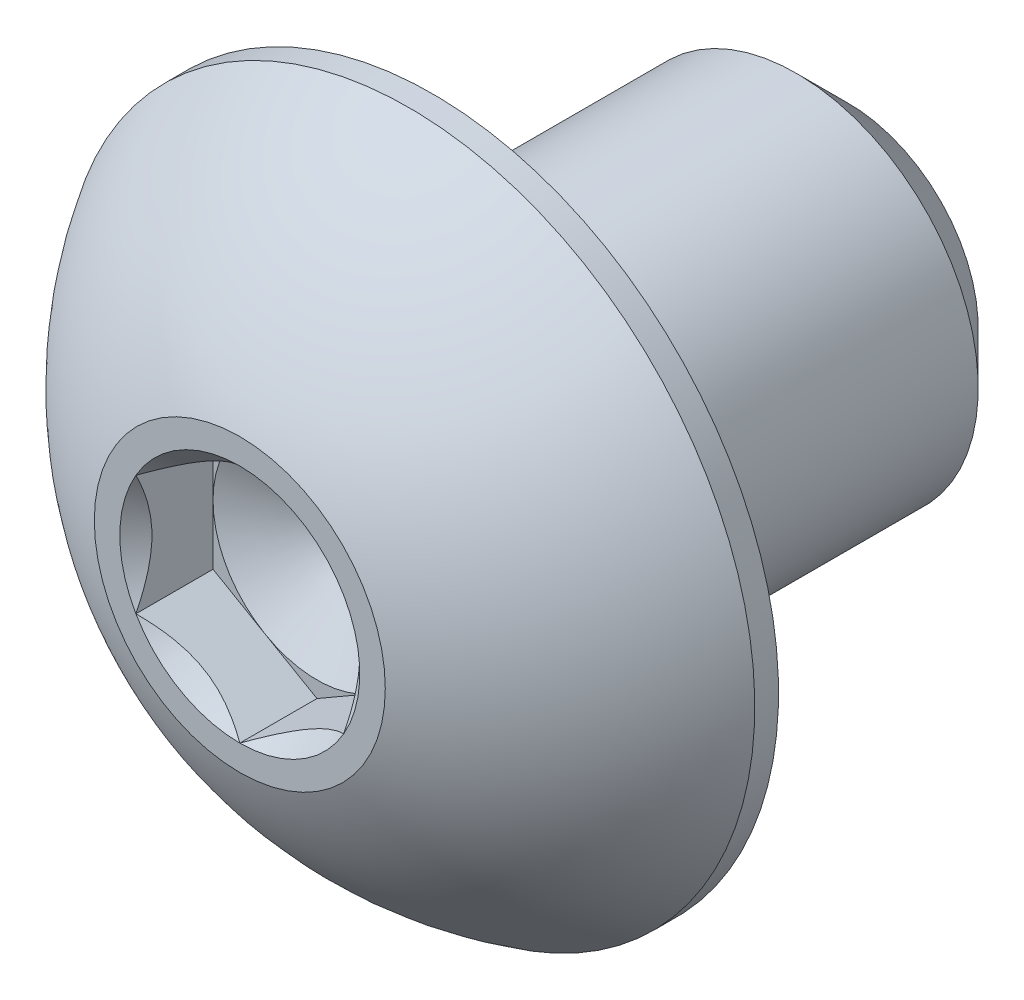
ISO-10303-21;
HEADER;
FILE_DESCRIPTION(('STEP AP214'),'2;1');
FILE_NAME('part.step','',(''),(''),'','','');
FILE_SCHEMA(('AUTOMOTIVE_DESIGN { 1 0 10303 214 1 1 1 1 }'));
ENDSEC;
DATA;
#1=APPLICATION_CONTEXT('core data for automotive mechanical design processes');
#2=APPLICATION_PROTOCOL_DEFINITION('international standard','automotive_design',2000,#1);
#3=PRODUCT_CONTEXT('',#1,'mechanical');
#4=PRODUCT('Part','Part','',(#3));
#5=PRODUCT_RELATED_PRODUCT_CATEGORY('part','',(#4));
#6=PRODUCT_DEFINITION_FORMATION('','',#4);
#7=PRODUCT_DEFINITION_CONTEXT('part definition',#1,'design');
#8=PRODUCT_DEFINITION('design','',#6,#7);
#9=PRODUCT_DEFINITION_SHAPE('','',#8);
#10=(LENGTH_UNIT() NAMED_UNIT(*) SI_UNIT(.MILLI.,.METRE.));
#11=(NAMED_UNIT(*) PLANE_ANGLE_UNIT() SI_UNIT($,.RADIAN.));
#12=(NAMED_UNIT(*) SI_UNIT($,.STERADIAN.) SOLID_ANGLE_UNIT());
#13=UNCERTAINTY_MEASURE_WITH_UNIT(LENGTH_MEASURE(1.E-05),#10,'distance_accuracy_value','');
#14=(GEOMETRIC_REPRESENTATION_CONTEXT(3) GLOBAL_UNCERTAINTY_ASSIGNED_CONTEXT((#13)) GLOBAL_UNIT_ASSIGNED_CONTEXT((#10,
#11,#12)) REPRESENTATION_CONTEXT('',''));
#15=CARTESIAN_POINT('',(0.,0.,0.));
#16=DIRECTION('',(0.,0.,1.));
#17=DIRECTION('',(1.,0.,0.));
#18=AXIS2_PLACEMENT_3D('',#15,#16,#17);
#19=CARTESIAN_POINT('',(0.,0.,2.60223));
#20=DIRECTION('',(0.,0.,1.));
#21=DIRECTION('',(1.,0.,0.));
#22=AXIS2_PLACEMENT_3D('',#19,#20,#21);
#23=PLANE('',#22);
#24=DIRECTION('',(0.,1.,0.));
#25=VECTOR('',#24,1.);
#26=CARTESIAN_POINT('',(-1.190625,0.687407664253898,2.60223));
#27=LINE('',#26,#25);
#28=CARTESIAN_POINT('',(-1.190625,-0.687407664253899,2.60223));
#29=VERTEX_POINT('',#28);
#30=CARTESIAN_POINT('',(-1.1906249999678,2.16066967707726E-13,2.60222999997774));
#31=VERTEX_POINT('',#30);
#32=EDGE_CURVE('E11',#29,#31,#27,.T.);
#33=ORIENTED_EDGE('',*,*,#32,.F.);
#34=DIRECTION('',(-0.866025403784439,0.5,0.));
#35=VECTOR('',#34,1.);
#36=CARTESIAN_POINT('',(-1.190625,-0.687407664253899,2.60223));
#37=LINE('',#36,#35);
#38=CARTESIAN_POINT('',(-0.595312499983901,-1.03111149635297,2.60222999997774));
#39=VERTEX_POINT('',#38);
#40=EDGE_CURVE('E257',#39,#29,#37,.T.);
#41=ORIENTED_EDGE('',*,*,#40,.F.);
#42=CARTESIAN_POINT('',(0.,0.,2.60222999995547));
#43=DIRECTION('',(0.,0.,-1.));
#44=DIRECTION('',(1.,0.,0.));
#45=AXIS2_PLACEMENT_3D('',#42,#43,#44);
#46=CIRCLE('',#45,1.19062499993561);
#47=EDGE_CURVE('E179',#39,#31,#46,.T.);
#48=ORIENTED_EDGE('',*,*,#47,.T.);
#49=EDGE_LOOP('',(#33,#41,#48));
#50=FACE_BOUND('',#49,.T.);
#51=ADVANCED_FACE('F17',(#50),#23,.T.);
#52=CARTESIAN_POINT('',(0.,0.,2.60223));
#53=DIRECTION('',(0.,0.,1.));
#54=DIRECTION('',(1.,0.,0.));
#55=AXIS2_PLACEMENT_3D('',#52,#53,#54);
#56=PLANE('',#55);
#57=DIRECTION('',(-0.866025403784439,0.5,0.));
#58=VECTOR('',#57,1.);
#59=CARTESIAN_POINT('',(-1.190625,-0.687407664253899,2.60223));
#60=LINE('',#59,#58);
#61=CARTESIAN_POINT('',(0.,-1.3748153285078,2.60223));
#62=VERTEX_POINT('',#61);
#63=EDGE_CURVE('E263',#62,#39,#60,.T.);
#64=ORIENTED_EDGE('',*,*,#63,.F.);
#65=DIRECTION('',(-0.866025403784439,-0.5,0.));
#66=VECTOR('',#65,1.);
#67=CARTESIAN_POINT('',(0.,-1.3748153285078,2.60223));
#68=LINE('',#67,#66);
#69=CARTESIAN_POINT('',(0.595312499983902,-1.03111149635296,2.60222999997774));
#70=VERTEX_POINT('',#69);
#71=EDGE_CURVE('E145',#70,#62,#68,.T.);
#72=ORIENTED_EDGE('',*,*,#71,.F.);
#73=CARTESIAN_POINT('',(0.,0.,2.60222999995547));
#74=DIRECTION('',(0.,0.,-1.));
#75=DIRECTION('',(1.,0.,0.));
#76=AXIS2_PLACEMENT_3D('',#73,#74,#75);
#77=CIRCLE('',#76,1.19062499993561);
#78=EDGE_CURVE('E172',#70,#39,#77,.T.);
#79=ORIENTED_EDGE('',*,*,#78,.T.);
#80=EDGE_LOOP('',(#64,#72,#79));
#81=FACE_BOUND('',#80,.T.);
#82=ADVANCED_FACE('F309',(#81),#56,.T.);
#83=CARTESIAN_POINT('',(0.,0.,2.60223));
#84=DIRECTION('',(0.,0.,1.));
#85=DIRECTION('',(1.,0.,0.));
#86=AXIS2_PLACEMENT_3D('',#83,#84,#85);
#87=PLANE('',#86);
#88=DIRECTION('',(-0.866025403784439,-0.5,0.));
#89=VECTOR('',#88,1.);
#90=CARTESIAN_POINT('',(0.,-1.3748153285078,2.60223));
#91=LINE('',#90,#89);
#92=CARTESIAN_POINT('',(1.190625,-0.687407664253898,2.60223));
#93=VERTEX_POINT('',#92);
#94=EDGE_CURVE('E154',#93,#70,#91,.T.);
#95=ORIENTED_EDGE('',*,*,#94,.F.);
#96=DIRECTION('',(0.,-1.,0.));
#97=VECTOR('',#96,1.);
#98=CARTESIAN_POINT('',(1.190625,-0.687407664253898,2.60223));
#99=LINE('',#98,#97);
#100=CARTESIAN_POINT('',(1.1906249999678,0.,2.60222999997774));
#101=VERTEX_POINT('',#100);
#102=EDGE_CURVE('E140',#101,#93,#99,.T.);
#103=ORIENTED_EDGE('',*,*,#102,.F.);
#104=CARTESIAN_POINT('',(0.,0.,2.60222999995547));
#105=DIRECTION('',(0.,0.,-1.));
#106=DIRECTION('',(1.,0.,0.));
#107=AXIS2_PLACEMENT_3D('',#104,#105,#106);
#108=CIRCLE('',#107,1.19062499993561);
#109=EDGE_CURVE('E152',#101,#70,#108,.T.);
#110=ORIENTED_EDGE('',*,*,#109,.T.);
#111=EDGE_LOOP('',(#95,#103,#110));
#112=FACE_BOUND('',#111,.T.);
#113=ADVANCED_FACE('F150',(#112),#87,.T.);
#114=CARTESIAN_POINT('',(0.,0.,2.60223));
#115=DIRECTION('',(0.,0.,1.));
#116=DIRECTION('',(1.,0.,0.));
#117=AXIS2_PLACEMENT_3D('',#114,#115,#116);
#118=PLANE('',#117);
#119=DIRECTION('',(0.,-1.,0.));
#120=VECTOR('',#119,1.);
#121=CARTESIAN_POINT('',(1.190625,-0.687407664253898,2.60223));
#122=LINE('',#121,#120);
#123=CARTESIAN_POINT('',(1.190625,0.687407664253899,2.60223));
#124=VERTEX_POINT('',#123);
#125=EDGE_CURVE('E137',#124,#101,#122,.T.);
#126=ORIENTED_EDGE('',*,*,#125,.F.);
#127=DIRECTION('',(0.866025403784439,-0.5,0.));
#128=VECTOR('',#127,1.);
#129=CARTESIAN_POINT('',(1.190625,0.687407664253899,2.60223));
#130=LINE('',#129,#128);
#131=CARTESIAN_POINT('',(0.595312499983901,1.03111149635297,2.60222999997774));
#132=VERTEX_POINT('',#131);
#133=EDGE_CURVE('E161',#132,#124,#130,.T.);
#134=ORIENTED_EDGE('',*,*,#133,.F.);
#135=CARTESIAN_POINT('',(0.,0.,2.60222999995547));
#136=DIRECTION('',(0.,0.,-1.));
#137=DIRECTION('',(1.,0.,0.));
#138=AXIS2_PLACEMENT_3D('',#135,#136,#137);
#139=CIRCLE('',#138,1.19062499993561);
#140=EDGE_CURVE('E159',#132,#101,#139,.T.);
#141=ORIENTED_EDGE('',*,*,#140,.T.);
#142=EDGE_LOOP('',(#126,#134,#141));
#143=FACE_BOUND('',#142,.T.);
#144=ADVANCED_FACE('F160',(#143),#118,.T.);
#145=CARTESIAN_POINT('',(0.,0.,2.60223));
#146=DIRECTION('',(0.,0.,1.));
#147=DIRECTION('',(1.,0.,0.));
#148=AXIS2_PLACEMENT_3D('',#145,#146,#147);
#149=PLANE('',#148);
#150=DIRECTION('',(0.866025403784439,0.5,0.));
#151=VECTOR('',#150,1.);
#152=CARTESIAN_POINT('',(0.,1.3748153285078,2.60223));
#153=LINE('',#152,#151);
#154=CARTESIAN_POINT('',(-1.190625,0.687407664253898,2.60223));
#155=VERTEX_POINT('',#154);
#156=CARTESIAN_POINT('',(-0.595312499983902,1.03111149635296,2.60222999997774));
#157=VERTEX_POINT('',#156);
#158=EDGE_CURVE('E214',#155,#157,#153,.T.);
#159=ORIENTED_EDGE('',*,*,#158,.F.);
#160=DIRECTION('',(0.,1.,0.));
#161=VECTOR('',#160,1.);
#162=CARTESIAN_POINT('',(-1.190625,0.687407664253898,2.60223));
#163=LINE('',#162,#161);
#164=EDGE_CURVE('E30',#31,#155,#163,.T.);
#165=ORIENTED_EDGE('',*,*,#164,.F.);
#166=CARTESIAN_POINT('',(0.,0.,2.60222999995547));
#167=DIRECTION('',(0.,0.,-1.));
#168=DIRECTION('',(1.,0.,0.));
#169=AXIS2_PLACEMENT_3D('',#166,#167,#168);
#170=CIRCLE('',#169,1.19062499993561);
#171=EDGE_CURVE('E220',#31,#157,#170,.T.);
#172=ORIENTED_EDGE('',*,*,#171,.T.);
#173=EDGE_LOOP('',(#159,#165,#172));
#174=FACE_BOUND('',#173,.T.);
#175=ADVANCED_FACE('F683',(#174),#149,.T.);
#176=CARTESIAN_POINT('',(0.,0.,2.60223));
#177=DIRECTION('',(0.,0.,1.));
#178=DIRECTION('',(1.,0.,0.));
#179=AXIS2_PLACEMENT_3D('',#176,#177,#178);
#180=PLANE('',#179);
#181=DIRECTION('',(0.866025403784439,-0.5,0.));
#182=VECTOR('',#181,1.);
#183=CARTESIAN_POINT('',(1.190625,0.687407664253899,2.60223));
#184=LINE('',#183,#182);
#185=CARTESIAN_POINT('',(0.,1.3748153285078,2.60223));
#186=VERTEX_POINT('',#185);
#187=EDGE_CURVE('E156',#186,#132,#184,.T.);
#188=ORIENTED_EDGE('',*,*,#187,.F.);
#189=DIRECTION('',(0.866025403784439,0.5,0.));
#190=VECTOR('',#189,1.);
#191=CARTESIAN_POINT('',(0.,1.3748153285078,2.60223));
#192=LINE('',#191,#190);
#193=EDGE_CURVE('E192',#157,#186,#192,.T.);
#194=ORIENTED_EDGE('',*,*,#193,.F.);
#195=CARTESIAN_POINT('',(0.,0.,2.60222999995547));
#196=DIRECTION('',(0.,0.,-1.));
#197=DIRECTION('',(1.,0.,0.));
#198=AXIS2_PLACEMENT_3D('',#195,#196,#197);
#199=CIRCLE('',#198,1.19062499993561);
#200=EDGE_CURVE('E166',#157,#132,#199,.T.);
#201=ORIENTED_EDGE('',*,*,#200,.T.);
#202=EDGE_LOOP('',(#188,#194,#201));
#203=FACE_BOUND('',#202,.T.);
#204=ADVANCED_FACE('F672',(#203),#180,.T.);
#205=CARTESIAN_POINT('',(-1.190625,0.687407664253898,3.48615));
#206=DIRECTION('',(1.,0.,0.));
#207=DIRECTION('',(0.,1.,0.));
#208=AXIS2_PLACEMENT_3D('',#205,#206,#207);
#209=PLANE('',#208);
#210=ORIENTED_EDGE('',*,*,#164,.T.);
#211=DIRECTION('',(0.,0.,-1.));
#212=VECTOR('',#211,1.);
#213=CARTESIAN_POINT('',(-1.190625,0.687407664253898,3.48615));
#214=LINE('',#213,#212);
#215=CARTESIAN_POINT('',(-1.19062499995943,0.687407664264676,3.48615000003183));
#216=VERTEX_POINT('',#215);
#217=EDGE_CURVE('E191',#216,#155,#214,.T.);
#218=ORIENTED_EDGE('',*,*,#217,.F.);
#219=CARTESIAN_POINT('',(-1.190625,0.687407664250615,3.48615000005993));
#220=CARTESIAN_POINT('',(-1.190625,5.79805647937803E-12,3.14244616804419));
#221=CARTESIAN_POINT('',(-1.190625,-0.687407664235154,3.4861500000522));
#222=(BOUNDED_CURVE() B_SPLINE_CURVE(2,(#219,#220,#221),.UNSPECIFIED.,.F.,
.F.) B_SPLINE_CURVE_WITH_KNOTS((3,3),(0.126894256979399,0.347424905152073),
.UNSPECIFIED.) CURVE() GEOMETRIC_REPRESENTATION_ITEM() RATIONAL_B_SPLINE_CURVE((1.38979663224803,
1.60479891949046,1.38979663225222)) REPRESENTATION_ITEM(''));
#223=CARTESIAN_POINT('',(-1.19062499997972,-0.687407664242189,3.48615000003815));
#224=VERTEX_POINT('',#223);
#225=EDGE_CURVE('E21',#216,#224,#222,.T.);
#226=ORIENTED_EDGE('',*,*,#225,.T.);
#227=DIRECTION('',(0.,0.,1.));
#228=VECTOR('',#227,1.);
#229=CARTESIAN_POINT('',(-1.190625,-0.687407664253899,3.48615));
#230=LINE('',#229,#228);
#231=EDGE_CURVE('E289',#29,#224,#230,.T.);
#232=ORIENTED_EDGE('',*,*,#231,.F.);
#233=ORIENTED_EDGE('',*,*,#32,.T.);
#234=EDGE_LOOP('',(#210,#218,#226,#232,#233));
#235=FACE_BOUND('',#234,.T.);
#236=ADVANCED_FACE('F663',(#235),#209,.T.);
#237=CARTESIAN_POINT('',(-1.190625,-0.687407664253899,3.48615));
#238=DIRECTION('',(0.5,0.866025403784439,0.));
#239=DIRECTION('',(0.,0.,-1.));
#240=AXIS2_PLACEMENT_3D('',#237,#238,#239);
#241=PLANE('',#240);
#242=ORIENTED_EDGE('',*,*,#40,.T.);
#243=ORIENTED_EDGE('',*,*,#231,.T.);
#244=CARTESIAN_POINT('',(-1.19062499998377,-0.687407664263272,3.4861500000522));
#245=CARTESIAN_POINT('',(-0.595312499999999,-1.03111149638085,3.14244616804698));
#246=CARTESIAN_POINT('',(-1.62321981368385E-11,-1.37481532849843,3.4861500000522));
#247=(BOUNDED_CURVE() B_SPLINE_CURVE(2,(#244,#245,#246),.UNSPECIFIED.,.F.,
.F.) B_SPLINE_CURVE_WITH_KNOTS((3,3),(0.126894256981522,0.347424905152042),
.UNSPECIFIED.) CURVE() GEOMETRIC_REPRESENTATION_ITEM() RATIONAL_B_SPLINE_CURVE((1.3897966322521,
1.60479891948823,1.3897966322521)) REPRESENTATION_ITEM(''));
#248=CARTESIAN_POINT('',(0.,-1.37481532848438,3.48615000003815));
#249=VERTEX_POINT('',#248);
#250=EDGE_CURVE('E280',#224,#249,#247,.T.);
#251=ORIENTED_EDGE('',*,*,#250,.T.);
#252=DIRECTION('',(0.,0.,1.));
#253=VECTOR('',#252,1.);
#254=CARTESIAN_POINT('',(0.,-1.3748153285078,3.48615));
#255=LINE('',#254,#253);
#256=EDGE_CURVE('E236',#62,#249,#255,.T.);
#257=ORIENTED_EDGE('',*,*,#256,.F.);
#258=ORIENTED_EDGE('',*,*,#63,.T.);
#259=EDGE_LOOP('',(#242,#243,#251,#257,#258));
#260=FACE_BOUND('',#259,.T.);
#261=ADVANCED_FACE('F303',(#260),#241,.T.);
#262=CARTESIAN_POINT('',(0.,-1.3748153285078,3.48615));
#263=DIRECTION('',(-0.5,0.866025403784439,0.));
#264=DIRECTION('',(0.,0.,1.));
#265=AXIS2_PLACEMENT_3D('',#262,#263,#264);
#266=PLANE('',#265);
#267=ORIENTED_EDGE('',*,*,#71,.T.);
#268=ORIENTED_EDGE('',*,*,#256,.T.);
#269=CARTESIAN_POINT('',(1.62357929099837E-11,-1.37481532849842,3.4861500000522));
#270=CARTESIAN_POINT('',(0.5953125,-1.03111149638085,3.14244616804699));
#271=CARTESIAN_POINT('',(1.19062499998376,-0.687407664263271,3.4861500000522));
#272=(BOUNDED_CURVE() B_SPLINE_CURVE(2,(#269,#270,#271),.UNSPECIFIED.,.F.,
.F.) B_SPLINE_CURVE_WITH_KNOTS((3,3),(0.126894256981523,0.347424905152041),
.UNSPECIFIED.) CURVE() GEOMETRIC_REPRESENTATION_ITEM() RATIONAL_B_SPLINE_CURVE((1.3897966322521,
1.60479891948823,1.3897966322521)) REPRESENTATION_ITEM(''));
#273=CARTESIAN_POINT('',(1.19062499997972,-0.687407664242187,3.48615000003815));
#274=VERTEX_POINT('',#273);
#275=EDGE_CURVE('E275',#249,#274,#272,.T.);
#276=ORIENTED_EDGE('',*,*,#275,.T.);
#277=DIRECTION('',(0.,0.,1.));
#278=VECTOR('',#277,1.);
#279=CARTESIAN_POINT('',(1.190625,-0.687407664253898,3.48615));
#280=LINE('',#279,#278);
#281=EDGE_CURVE('E94',#93,#274,#280,.T.);
#282=ORIENTED_EDGE('',*,*,#281,.F.);
#283=ORIENTED_EDGE('',*,*,#94,.T.);
#284=EDGE_LOOP('',(#267,#268,#276,#282,#283));
#285=FACE_BOUND('',#284,.T.);
#286=ADVANCED_FACE('F644',(#285),#266,.T.);
#287=CARTESIAN_POINT('',(1.190625,-0.687407664253898,3.48615));
#288=DIRECTION('',(-1.,0.,0.));
#289=DIRECTION('',(0.,1.,0.));
#290=AXIS2_PLACEMENT_3D('',#287,#288,#289);
#291=PLANE('',#290);
#292=ORIENTED_EDGE('',*,*,#102,.T.);
#293=ORIENTED_EDGE('',*,*,#281,.T.);
#294=CARTESIAN_POINT('',(1.190625,-0.687407664235152,3.4861500000522));
#295=CARTESIAN_POINT('',(1.190625,0.,3.14244616804709));
#296=CARTESIAN_POINT('',(1.190625,0.687407664235153,3.4861500000522));
#297=(BOUNDED_CURVE() B_SPLINE_CURVE(2,(#294,#295,#296),.UNSPECIFIED.,.F.,
.F.) B_SPLINE_CURVE_WITH_KNOTS((3,3),(0.126894256981548,0.347424905152074),
.UNSPECIFIED.) CURVE() GEOMETRIC_REPRESENTATION_ITEM() RATIONAL_B_SPLINE_CURVE((1.38979663225222,
1.60479891948837,1.38979663225222)) REPRESENTATION_ITEM(''));
#298=CARTESIAN_POINT('',(1.19062499997972,0.687407664242187,3.48615000003815));
#299=VERTEX_POINT('',#298);
#300=EDGE_CURVE('E269',#274,#299,#297,.T.);
#301=ORIENTED_EDGE('',*,*,#300,.T.);
#302=DIRECTION('',(0.,0.,1.));
#303=VECTOR('',#302,1.);
#304=CARTESIAN_POINT('',(1.190625,0.687407664253899,3.48615));
#305=LINE('',#304,#303);
#306=EDGE_CURVE('E118',#124,#299,#305,.T.);
#307=ORIENTED_EDGE('',*,*,#306,.F.);
#308=ORIENTED_EDGE('',*,*,#125,.T.);
#309=EDGE_LOOP('',(#292,#293,#301,#307,#308));
#310=FACE_BOUND('',#309,.T.);
#311=ADVANCED_FACE('F139',(#310),#291,.T.);
#312=CARTESIAN_POINT('',(1.190625,0.687407664253899,3.48615));
#313=DIRECTION('',(-0.5,-0.866025403784439,0.));
#314=DIRECTION('',(-0.866025403784439,0.5,0.));
#315=AXIS2_PLACEMENT_3D('',#312,#313,#314);
#316=PLANE('',#315);
#317=ORIENTED_EDGE('',*,*,#133,.T.);
#318=ORIENTED_EDGE('',*,*,#306,.T.);
#319=CARTESIAN_POINT('',(1.19062499998377,0.687407664263272,3.4861500000522));
#320=CARTESIAN_POINT('',(0.5953125,1.03111149638085,3.14244616804698));
#321=CARTESIAN_POINT('',(1.62335162203251E-11,1.37481532849842,3.4861500000522));
#322=(BOUNDED_CURVE() B_SPLINE_CURVE(2,(#319,#320,#321),.UNSPECIFIED.,.F.,
.F.) B_SPLINE_CURVE_WITH_KNOTS((3,3),(0.126894256981522,0.347424905152042),
.UNSPECIFIED.) CURVE() GEOMETRIC_REPRESENTATION_ITEM() RATIONAL_B_SPLINE_CURVE((1.3897966322521,
1.60479891948823,1.3897966322521)) REPRESENTATION_ITEM(''));
#323=CARTESIAN_POINT('',(0.,1.37481532848438,3.48615000003815));
#324=VERTEX_POINT('',#323);
#325=EDGE_CURVE('E264',#299,#324,#322,.T.);
#326=ORIENTED_EDGE('',*,*,#325,.T.);
#327=DIRECTION('',(0.,0.,1.));
#328=VECTOR('',#327,1.);
#329=CARTESIAN_POINT('',(0.,1.3748153285078,3.48615));
#330=LINE('',#329,#328);
#331=EDGE_CURVE('E107',#186,#324,#330,.T.);
#332=ORIENTED_EDGE('',*,*,#331,.F.);
#333=ORIENTED_EDGE('',*,*,#187,.T.);
#334=EDGE_LOOP('',(#317,#318,#326,#332,#333));
#335=FACE_BOUND('',#334,.T.);
#336=ADVANCED_FACE('F626',(#335),#316,.T.);
#337=CARTESIAN_POINT('',(0.,1.3748153285078,3.48615));
#338=DIRECTION('',(0.5,-0.866025403784439,0.));
#339=DIRECTION('',(0.,0.,-1.));
#340=AXIS2_PLACEMENT_3D('',#337,#338,#339);
#341=PLANE('',#340);
#342=ORIENTED_EDGE('',*,*,#193,.T.);
#343=ORIENTED_EDGE('',*,*,#331,.T.);
#344=CARTESIAN_POINT('',(-1.62343550007256E-11,1.37481532849842,3.4861500000522));
#345=CARTESIAN_POINT('',(-0.595312499991694,1.03111149638564,3.14244616805178));
#346=CARTESIAN_POINT('',(-1.19062499996161,0.687407664276059,3.48615000003941));
#347=(BOUNDED_CURVE() B_SPLINE_CURVE(2,(#344,#345,#346),.UNSPECIFIED.,.F.,
.F.) B_SPLINE_CURVE_WITH_KNOTS((3,3),(0.126894256981523,0.347424905148488),
.UNSPECIFIED.) CURVE() GEOMETRIC_REPRESENTATION_ITEM() RATIONAL_B_SPLINE_CURVE((1.3897966322521,
1.60479891948476,1.38979663225903)) REPRESENTATION_ITEM(''));
#348=EDGE_CURVE('E209',#324,#216,#347,.T.);
#349=ORIENTED_EDGE('',*,*,#348,.T.);
#350=ORIENTED_EDGE('',*,*,#217,.T.);
#351=ORIENTED_EDGE('',*,*,#158,.T.);
#352=EDGE_LOOP('',(#342,#343,#349,#350,#351));
#353=FACE_BOUND('',#352,.T.);
#354=ADVANCED_FACE('F616',(#353),#341,.T.);
#355=CARTESIAN_POINT('',(0.,0.,3.48615000012842));
#356=DIRECTION('',(0.,0.,1.));
#357=DIRECTION('',(0.,-1.,0.));
#358=AXIS2_PLACEMENT_3D('',#355,#356,#357);
#359=CONICAL_SURFACE('',#358,1.37481532857464,0.785398163550829);
#360=ORIENTED_EDGE('',*,*,#225,.F.);
#361=CARTESIAN_POINT('',(0.,0.,3.48615000001473));
#362=DIRECTION('',(0.,0.,1.));
#363=DIRECTION('',(0.,-1.,0.));
#364=AXIS2_PLACEMENT_3D('',#361,#362,#363);
#365=CIRCLE('',#364,1.37481532846095);
#366=EDGE_CURVE('E210',#216,#224,#365,.T.);
#367=ORIENTED_EDGE('',*,*,#366,.T.);
#368=EDGE_LOOP('',(#360,#367));
#369=FACE_BOUND('',#368,.T.);
#370=ADVANCED_FACE('F19',(#369),#359,.F.);
#371=CARTESIAN_POINT('',(0.,0.,3.48615000012842));
#372=DIRECTION('',(0.,0.,1.));
#373=DIRECTION('',(0.,-1.,0.));
#374=AXIS2_PLACEMENT_3D('',#371,#372,#373);
#375=CONICAL_SURFACE('',#374,1.37481532857464,0.785398163550677);
#376=ORIENTED_EDGE('',*,*,#250,.F.);
#377=CARTESIAN_POINT('',(0.,0.,3.48615000001473));
#378=DIRECTION('',(0.,0.,1.));
#379=DIRECTION('',(0.,-1.,0.));
#380=AXIS2_PLACEMENT_3D('',#377,#378,#379);
#381=CIRCLE('',#380,1.37481532846095);
#382=EDGE_CURVE('E230',#224,#249,#381,.T.);
#383=ORIENTED_EDGE('',*,*,#382,.T.);
#384=EDGE_LOOP('',(#376,#383));
#385=FACE_BOUND('',#384,.T.);
#386=ADVANCED_FACE('F596',(#385),#375,.F.);
#387=CARTESIAN_POINT('',(0.,0.,3.48615000012842));
#388=DIRECTION('',(0.,0.,1.));
#389=DIRECTION('',(0.,-1.,0.));
#390=AXIS2_PLACEMENT_3D('',#387,#388,#389);
#391=CONICAL_SURFACE('',#390,1.37481532857464,0.785398163550677);
#392=ORIENTED_EDGE('',*,*,#275,.F.);
#393=CARTESIAN_POINT('',(0.,0.,3.48615000001473));
#394=DIRECTION('',(0.,0.,1.));
#395=DIRECTION('',(0.,-1.,0.));
#396=AXIS2_PLACEMENT_3D('',#393,#394,#395);
#397=CIRCLE('',#396,1.37481532846095);
#398=EDGE_CURVE('E225',#249,#274,#397,.T.);
#399=ORIENTED_EDGE('',*,*,#398,.T.);
#400=EDGE_LOOP('',(#392,#399));
#401=FACE_BOUND('',#400,.T.);
#402=ADVANCED_FACE('F585',(#401),#391,.F.);
#403=CARTESIAN_POINT('',(0.,0.,3.48615000012842));
#404=DIRECTION('',(0.,0.,1.));
#405=DIRECTION('',(0.,-1.,0.));
#406=AXIS2_PLACEMENT_3D('',#403,#404,#405);
#407=CONICAL_SURFACE('',#406,1.37481532857464,0.785398163550835);
#408=ORIENTED_EDGE('',*,*,#300,.F.);
#409=CARTESIAN_POINT('',(0.,0.,3.48615000001473));
#410=DIRECTION('',(0.,0.,1.));
#411=DIRECTION('',(0.,-1.,0.));
#412=AXIS2_PLACEMENT_3D('',#409,#410,#411);
#413=CIRCLE('',#412,1.37481532846095);
#414=EDGE_CURVE('E221',#274,#299,#413,.T.);
#415=ORIENTED_EDGE('',*,*,#414,.T.);
#416=EDGE_LOOP('',(#408,#415));
#417=FACE_BOUND('',#416,.T.);
#418=ADVANCED_FACE('F574',(#417),#407,.F.);
#419=CARTESIAN_POINT('',(0.,0.,3.48615000012842));
#420=DIRECTION('',(0.,0.,1.));
#421=DIRECTION('',(0.,-1.,0.));
#422=AXIS2_PLACEMENT_3D('',#419,#420,#421);
#423=CONICAL_SURFACE('',#422,1.37481532857464,0.785398163550677);
#424=ORIENTED_EDGE('',*,*,#325,.F.);
#425=CARTESIAN_POINT('',(0.,0.,3.48615000001473));
#426=DIRECTION('',(0.,0.,1.));
#427=DIRECTION('',(0.,-1.,0.));
#428=AXIS2_PLACEMENT_3D('',#425,#426,#427);
#429=CIRCLE('',#428,1.37481532846095);
#430=EDGE_CURVE('E226',#299,#324,#429,.T.);
#431=ORIENTED_EDGE('',*,*,#430,.T.);
#432=EDGE_LOOP('',(#424,#431));
#433=FACE_BOUND('',#432,.T.);
#434=ADVANCED_FACE('F564',(#433),#423,.F.);
#435=CARTESIAN_POINT('',(0.,0.,3.48615000012842));
#436=DIRECTION('',(0.,0.,1.));
#437=DIRECTION('',(0.,-1.,0.));
#438=AXIS2_PLACEMENT_3D('',#435,#436,#437);
#439=CONICAL_SURFACE('',#438,1.37481532857464,0.785398163550677);
#440=ORIENTED_EDGE('',*,*,#348,.F.);
#441=CARTESIAN_POINT('',(0.,0.,3.48615000001473));
#442=DIRECTION('',(0.,0.,1.));
#443=DIRECTION('',(0.,-1.,0.));
#444=AXIS2_PLACEMENT_3D('',#441,#442,#443);
#445=CIRCLE('',#444,1.37481532846095);
#446=EDGE_CURVE('E205',#324,#216,#445,.T.);
#447=ORIENTED_EDGE('',*,*,#446,.T.);
#448=EDGE_LOOP('',(#440,#447));
#449=FACE_BOUND('',#448,.T.);
#450=ADVANCED_FACE('F554',(#449),#439,.F.);
#451=CARTESIAN_POINT('',(0.,1.190625,3.48615));
#452=DIRECTION('',(0.,0.,-1.));
#453=DIRECTION('',(0.,-1.,0.));
#454=AXIS2_PLACEMENT_3D('',#451,#452,#453);
#455=PLANE('',#454);
#456=ORIENTED_EDGE('',*,*,#430,.F.);
#457=ORIENTED_EDGE('',*,*,#414,.F.);
#458=ORIENTED_EDGE('',*,*,#398,.F.);
#459=ORIENTED_EDGE('',*,*,#382,.F.);
#460=ORIENTED_EDGE('',*,*,#366,.F.);
#461=ORIENTED_EDGE('',*,*,#446,.F.);
#462=EDGE_LOOP('',(#456,#457,#458,#459,#460,#461));
#463=FACE_BOUND('',#462,.T.);
#464=CARTESIAN_POINT('',(0.,0.,3.48615));
#465=DIRECTION('',(0.,0.,-1.));
#466=DIRECTION('',(0.,-1.,0.));
#467=AXIS2_PLACEMENT_3D('',#464,#465,#466);
#468=CIRCLE('',#467,1.666875);
#469=CARTESIAN_POINT('',(0.,-1.666875,3.48615));
#470=VERTEX_POINT('',#469);
#471=EDGE_CURVE('E258',#470,#470,#468,.T.);
#472=ORIENTED_EDGE('',*,*,#471,.F.);
#473=EDGE_LOOP('',(#472));
#474=FACE_BOUND('',#473,.T.);
#475=ADVANCED_FACE('F541',(#463,#474),#455,.F.);
#476=CARTESIAN_POINT('',(0.,1.4874875,-3.48615));
#477=DIRECTION('',(0.,0.,1.));
#478=DIRECTION('',(1.,0.,0.));
#479=AXIS2_PLACEMENT_3D('',#476,#477,#478);
#480=PLANE('',#479);
#481=CARTESIAN_POINT('',(0.,0.,-3.48615000001473));
#482=DIRECTION('',(0.,0.,1.));
#483=DIRECTION('',(1.,0.,0.));
#484=AXIS2_PLACEMENT_3D('',#481,#482,#483);
#485=CIRCLE('',#484,1.48748750001459);
#486=CARTESIAN_POINT('',(-1.48748750001459,0.,-3.48615000001473));
#487=VERTEX_POINT('',#486);
#488=EDGE_CURVE('E199',#487,#487,#485,.T.);
#489=ORIENTED_EDGE('',*,*,#488,.F.);
#490=EDGE_LOOP('',(#489));
#491=FACE_BOUND('',#490,.T.);
#492=ADVANCED_FACE('F530',(#491),#480,.F.);
#493=CARTESIAN_POINT('',(0.,0.,-0.817154317566211));
#494=DIRECTION('',(0.,1.,0.));
#495=DIRECTION('',(1.,0.,0.));
#496=AXIS2_PLACEMENT_3D('',#493,#494,#495);
#497=SPHERICAL_SURFACE('',#496,4.61485647828933);
#498=CARTESIAN_POINT('',(0.,0.,-0.817154317566211));
#499=DIRECTION('',(0.,0.,-1.));
#500=DIRECTION('',(0.,-1.,0.));
#501=AXIS2_PLACEMENT_3D('',#498,#499,#500);
#502=SPHERICAL_SURFACE('',#501,4.61485647828933);
#503=ORIENTED_EDGE('',*,*,#471,.T.);
#504=EDGE_LOOP('',(#503));
#505=FACE_BOUND('',#504,.T.);
#506=CARTESIAN_POINT('',(0.,0.,1.54849285714286));
#507=DIRECTION('',(0.,0.,-1.));
#508=DIRECTION('',(1.,0.,0.));
#509=AXIS2_PLACEMENT_3D('',#506,#507,#508);
#510=CIRCLE('',#509,3.9624);
#511=CARTESIAN_POINT('',(-3.9624,0.,1.54849285714286));
#512=VERTEX_POINT('',#511);
#513=EDGE_CURVE('E194',#512,#512,#510,.T.);
#514=ORIENTED_EDGE('',*,*,#513,.F.);
#515=EDGE_LOOP('',(#514));
#516=FACE_BOUND('',#515,.T.);
#517=ADVANCED_FACE('F518',(#505,#516),#502,.T.);
#518=CARTESIAN_POINT('',(0.,3.9624,1.27635));
#519=DIRECTION('',(0.,0.,1.));
#520=DIRECTION('',(1.,0.,0.));
#521=AXIS2_PLACEMENT_3D('',#518,#519,#520);
#522=PLANE('',#521);
#523=CARTESIAN_POINT('',(0.,0.,1.27635));
#524=DIRECTION('',(0.,0.,-1.));
#525=DIRECTION('',(1.,0.,0.));
#526=AXIS2_PLACEMENT_3D('',#523,#524,#525);
#527=CIRCLE('',#526,2.0828);
#528=CARTESIAN_POINT('',(-2.0828,0.,1.27635));
#529=VERTEX_POINT('',#528);
#530=EDGE_CURVE('E189',#529,#529,#527,.T.);
#531=ORIENTED_EDGE('',*,*,#530,.F.);
#532=EDGE_LOOP('',(#531));
#533=FACE_BOUND('',#532,.T.);
#534=CARTESIAN_POINT('',(0.,0.,1.27635));
#535=DIRECTION('',(0.,0.,1.));
#536=DIRECTION('',(1.,0.,0.));
#537=AXIS2_PLACEMENT_3D('',#534,#535,#536);
#538=CIRCLE('',#537,3.9624);
#539=CARTESIAN_POINT('',(-3.9624,0.,1.27635));
#540=VERTEX_POINT('',#539);
#541=EDGE_CURVE('E250',#540,#540,#538,.T.);
#542=ORIENTED_EDGE('',*,*,#541,.F.);
#543=EDGE_LOOP('',(#542));
#544=FACE_BOUND('',#543,.T.);
#545=ADVANCED_FACE('F507',(#533,#544),#522,.F.);
#546=CARTESIAN_POINT('',(0.,0.,2.60222999992266));
#547=DIRECTION('',(0.,0.,1.));
#548=DIRECTION('',(1.,0.,0.));
#549=AXIS2_PLACEMENT_3D('',#546,#547,#548);
#550=CONICAL_SURFACE('',#549,1.19062499987876,1.0471975512003);
#551=DIRECTION('',(-0.866025403786288,0.,0.499999999996797));
#552=VECTOR('',#551,1.);
#553=CARTESIAN_POINT('',(-1.19062499987876,0.,2.60222999992266));
#554=LINE('',#553,#552);
#555=CARTESIAN_POINT('',(0.,0.,1.91482233574463));
#556=VERTEX_POINT('',#555);
#557=EDGE_CURVE('E203',#556,#31,#554,.T.);
#558=ORIENTED_EDGE('',*,*,#557,.T.);
#559=ORIENTED_EDGE('',*,*,#47,.F.);
#560=ORIENTED_EDGE('',*,*,#78,.F.);
#561=ORIENTED_EDGE('',*,*,#109,.F.);
#562=ORIENTED_EDGE('',*,*,#140,.F.);
#563=ORIENTED_EDGE('',*,*,#200,.F.);
#564=ORIENTED_EDGE('',*,*,#171,.F.);
#565=ORIENTED_EDGE('',*,*,#557,.F.);
#566=EDGE_LOOP('',(#558,#559,#560,#561,#562,#563,#564,#565));
#567=FACE_BOUND('',#566,.T.);
#568=ADVANCED_FACE('F169',(#567),#550,.F.);
#569=CARTESIAN_POINT('',(0.,0.,-2.89083749999008));
#570=DIRECTION('',(0.,0.,1.));
#571=DIRECTION('',(1.,0.,0.));
#572=AXIS2_PLACEMENT_3D('',#569,#570,#571);
#573=CONICAL_SURFACE('',#572,2.08280000003924,0.785398163397448);
#574=CARTESIAN_POINT('',(0.,0.,-2.8908375));
#575=DIRECTION('',(0.,0.,1.));
#576=DIRECTION('',(1.,0.,0.));
#577=AXIS2_PLACEMENT_3D('',#574,#575,#576);
#578=CIRCLE('',#577,2.0828);
#579=CARTESIAN_POINT('',(-2.0828,0.,-2.8908375));
#580=VERTEX_POINT('',#579);
#581=EDGE_CURVE('E188',#580,#580,#578,.T.);
#582=ORIENTED_EDGE('',*,*,#581,.F.);
#583=DIRECTION('',(0.707106781186548,0.,-0.707106781186548));
#584=VECTOR('',#583,1.);
#585=CARTESIAN_POINT('',(-2.08280000003924,0.,-2.89083749999008));
#586=LINE('',#585,#584);
#587=EDGE_CURVE('E204',#580,#487,#586,.T.);
#588=ORIENTED_EDGE('',*,*,#587,.T.);
#589=ORIENTED_EDGE('',*,*,#488,.T.);
#590=ORIENTED_EDGE('',*,*,#587,.F.);
#591=EDGE_LOOP('',(#582,#588,#589,#590));
#592=FACE_BOUND('',#591,.T.);
#593=ADVANCED_FACE('F482',(#592),#573,.T.);
#594=CARTESIAN_POINT('',(0.,0.,3.48615));
#595=DIRECTION('',(0.,0.,1.));
#596=DIRECTION('',(1.,0.,0.));
#597=AXIS2_PLACEMENT_3D('',#594,#595,#596);
#598=CYLINDRICAL_SURFACE('',#597,3.9624);
#599=ORIENTED_EDGE('',*,*,#513,.T.);
#600=DIRECTION('',(0.,0.,-1.));
#601=VECTOR('',#600,1.);
#602=CARTESIAN_POINT('',(-3.9624,0.,3.48615));
#603=LINE('',#602,#601);
#604=EDGE_CURVE('E198',#512,#540,#603,.T.);
#605=ORIENTED_EDGE('',*,*,#604,.T.);
#606=ORIENTED_EDGE('',*,*,#541,.T.);
#607=ORIENTED_EDGE('',*,*,#604,.F.);
#608=EDGE_LOOP('',(#599,#605,#606,#607));
#609=FACE_BOUND('',#608,.T.);
#610=ADVANCED_FACE('F469',(#609),#598,.T.);
#611=CARTESIAN_POINT('',(0.,0.,3.48615));
#612=DIRECTION('',(0.,0.,1.));
#613=DIRECTION('',(1.,0.,0.));
#614=AXIS2_PLACEMENT_3D('',#611,#612,#613);
#615=CYLINDRICAL_SURFACE('',#614,2.0828);
#616=ORIENTED_EDGE('',*,*,#530,.T.);
#617=DIRECTION('',(0.,0.,-1.));
#618=VECTOR('',#617,1.);
#619=CARTESIAN_POINT('',(-2.0828,0.,3.48615));
#620=LINE('',#619,#618);
#621=EDGE_CURVE('E184',#529,#580,#620,.T.);
#622=ORIENTED_EDGE('',*,*,#621,.T.);
#623=ORIENTED_EDGE('',*,*,#581,.T.);
#624=ORIENTED_EDGE('',*,*,#621,.F.);
#625=EDGE_LOOP('',(#616,#622,#623,#624));
#626=FACE_BOUND('',#625,.T.);
#627=ADVANCED_FACE('F463',(#626),#615,.T.);
#628=CLOSED_SHELL('',(#51,#82,#113,#144,#175,#204,#236,#261,#286,#311,#336,#354,#370,#386,#402,
#418,#434,#450,#475,#492,#517,#545,#568,#593,#610,#627));
#629=MANIFOLD_SOLID_BREP('B1',#628);
#630=ADVANCED_BREP_SHAPE_REPRESENTATION('',(#18,#629),#14);
#631=SHAPE_DEFINITION_REPRESENTATION(#9,#630);
ENDSEC;
END-ISO-10303-21;
